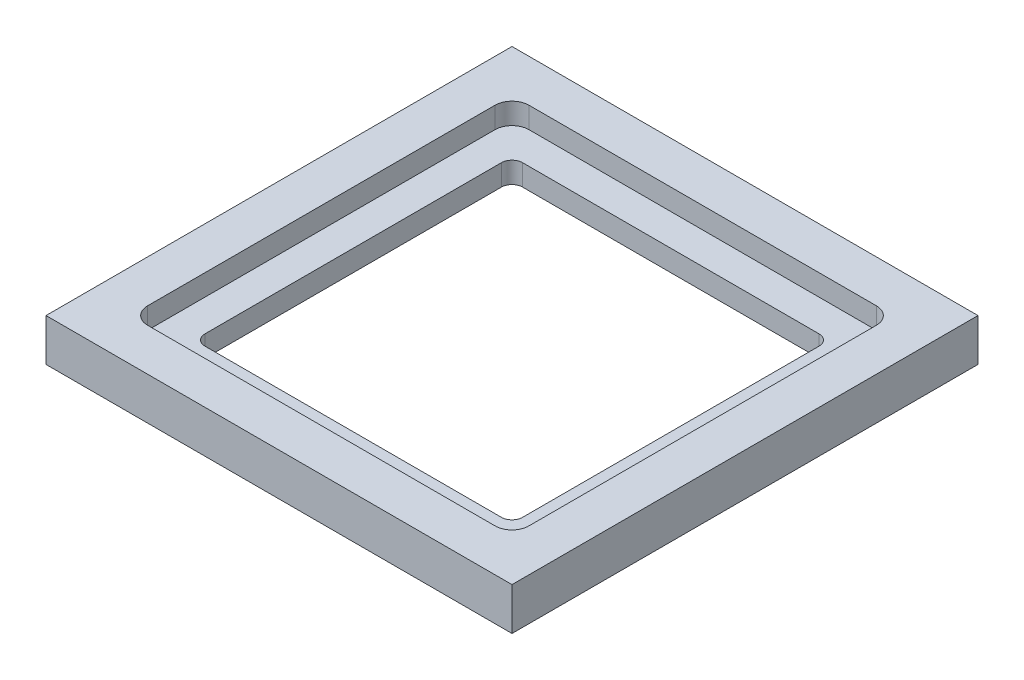
ISO-10303-21;
HEADER;
FILE_DESCRIPTION(('STEP AP214'),'2;1');
FILE_NAME('part.step','',(''),(''),'','','');
FILE_SCHEMA(('AUTOMOTIVE_DESIGN { 1 0 10303 214 1 1 1 1 }'));
ENDSEC;
DATA;
#1=APPLICATION_CONTEXT('core data for automotive mechanical design processes');
#2=APPLICATION_PROTOCOL_DEFINITION('international standard','automotive_design',2000,#1);
#3=PRODUCT_CONTEXT('',#1,'mechanical');
#4=PRODUCT('Part','Part','',(#3));
#5=PRODUCT_RELATED_PRODUCT_CATEGORY('part','',(#4));
#6=PRODUCT_DEFINITION_FORMATION('','',#4);
#7=PRODUCT_DEFINITION_CONTEXT('part definition',#1,'design');
#8=PRODUCT_DEFINITION('design','',#6,#7);
#9=PRODUCT_DEFINITION_SHAPE('','',#8);
#10=(LENGTH_UNIT() NAMED_UNIT(*) SI_UNIT(.MILLI.,.METRE.));
#11=(NAMED_UNIT(*) PLANE_ANGLE_UNIT() SI_UNIT($,.RADIAN.));
#12=(NAMED_UNIT(*) SI_UNIT($,.STERADIAN.) SOLID_ANGLE_UNIT());
#13=UNCERTAINTY_MEASURE_WITH_UNIT(LENGTH_MEASURE(1.E-05),#10,'distance_accuracy_value','');
#14=(GEOMETRIC_REPRESENTATION_CONTEXT(3) GLOBAL_UNCERTAINTY_ASSIGNED_CONTEXT((#13)) GLOBAL_UNIT_ASSIGNED_CONTEXT((#10,
#11,#12)) REPRESENTATION_CONTEXT('',''));
#15=CARTESIAN_POINT('',(0.,0.,0.));
#16=DIRECTION('',(0.,0.,1.));
#17=DIRECTION('',(1.,0.,0.));
#18=AXIS2_PLACEMENT_3D('',#15,#16,#17);
#19=CARTESIAN_POINT('',(0.,2.,22.));
#20=DIRECTION('',(0.,0.,-1.));
#21=DIRECTION('',(-1.,0.,0.));
#22=AXIS2_PLACEMENT_3D('',#19,#20,#21);
#23=PLANE('',#22);
#24=DIRECTION('',(0.,-1.,0.));
#25=VECTOR('',#24,1.);
#26=CARTESIAN_POINT('',(-22.,2.,22.));
#27=LINE('',#26,#25);
#28=CARTESIAN_POINT('',(-22.,2.,22.));
#29=VERTEX_POINT('',#28);
#30=CARTESIAN_POINT('',(-22.,-2.,22.));
#31=VERTEX_POINT('',#30);
#32=EDGE_CURVE('E194',#29,#31,#27,.T.);
#33=ORIENTED_EDGE('',*,*,#32,.T.);
#34=DIRECTION('',(-1.,0.,0.));
#35=VECTOR('',#34,1.);
#36=CARTESIAN_POINT('',(-22.,-2.,22.));
#37=LINE('',#36,#35);
#38=CARTESIAN_POINT('',(22.,-2.,22.));
#39=VERTEX_POINT('',#38);
#40=EDGE_CURVE('E193',#39,#31,#37,.T.);
#41=ORIENTED_EDGE('',*,*,#40,.F.);
#42=DIRECTION('',(0.,-1.,0.));
#43=VECTOR('',#42,1.);
#44=CARTESIAN_POINT('',(22.,2.,22.));
#45=LINE('',#44,#43);
#46=CARTESIAN_POINT('',(22.,2.,22.));
#47=VERTEX_POINT('',#46);
#48=EDGE_CURVE('E179',#47,#39,#45,.T.);
#49=ORIENTED_EDGE('',*,*,#48,.F.);
#50=DIRECTION('',(1.,0.,0.));
#51=VECTOR('',#50,1.);
#52=CARTESIAN_POINT('',(0.,2.,22.));
#53=LINE('',#52,#51);
#54=EDGE_CURVE('E228',#29,#47,#53,.T.);
#55=ORIENTED_EDGE('',*,*,#54,.F.);
#56=EDGE_LOOP('',(#33,#41,#49,#55));
#57=FACE_BOUND('',#56,.T.);
#58=ADVANCED_FACE('F41',(#57),#23,.F.);
#59=CARTESIAN_POINT('',(22.,2.,0.));
#60=DIRECTION('',(-1.,0.,0.));
#61=DIRECTION('',(0.,0.,1.));
#62=AXIS2_PLACEMENT_3D('',#59,#60,#61);
#63=PLANE('',#62);
#64=ORIENTED_EDGE('',*,*,#48,.T.);
#65=DIRECTION('',(0.,0.,1.));
#66=VECTOR('',#65,1.);
#67=CARTESIAN_POINT('',(22.,-2.,-22.));
#68=LINE('',#67,#66);
#69=CARTESIAN_POINT('',(22.,-2.,-22.));
#70=VERTEX_POINT('',#69);
#71=EDGE_CURVE('E184',#70,#39,#68,.T.);
#72=ORIENTED_EDGE('',*,*,#71,.F.);
#73=DIRECTION('',(0.,-1.,0.));
#74=VECTOR('',#73,1.);
#75=CARTESIAN_POINT('',(22.,2.,-22.));
#76=LINE('',#75,#74);
#77=CARTESIAN_POINT('',(22.,2.,-22.));
#78=VERTEX_POINT('',#77);
#79=EDGE_CURVE('E190',#78,#70,#76,.T.);
#80=ORIENTED_EDGE('',*,*,#79,.F.);
#81=DIRECTION('',(0.,0.,-1.));
#82=VECTOR('',#81,1.);
#83=CARTESIAN_POINT('',(22.,2.,0.));
#84=LINE('',#83,#82);
#85=EDGE_CURVE('E185',#47,#78,#84,.T.);
#86=ORIENTED_EDGE('',*,*,#85,.F.);
#87=EDGE_LOOP('',(#64,#72,#80,#86));
#88=FACE_BOUND('',#87,.T.);
#89=ADVANCED_FACE('F181',(#88),#63,.F.);
#90=CARTESIAN_POINT('',(0.,2.,-22.));
#91=DIRECTION('',(0.,0.,-1.));
#92=DIRECTION('',(-1.,0.,0.));
#93=AXIS2_PLACEMENT_3D('',#90,#91,#92);
#94=PLANE('',#93);
#95=ORIENTED_EDGE('',*,*,#79,.T.);
#96=DIRECTION('',(1.,0.,0.));
#97=VECTOR('',#96,1.);
#98=CARTESIAN_POINT('',(-22.,-2.,-22.));
#99=LINE('',#98,#97);
#100=CARTESIAN_POINT('',(-22.,-2.,-22.));
#101=VERTEX_POINT('',#100);
#102=EDGE_CURVE('E203',#101,#70,#99,.T.);
#103=ORIENTED_EDGE('',*,*,#102,.F.);
#104=DIRECTION('',(0.,-1.,0.));
#105=VECTOR('',#104,1.);
#106=CARTESIAN_POINT('',(-22.,2.,-22.));
#107=LINE('',#106,#105);
#108=CARTESIAN_POINT('',(-22.,2.,-22.));
#109=VERTEX_POINT('',#108);
#110=EDGE_CURVE('E246',#109,#101,#107,.T.);
#111=ORIENTED_EDGE('',*,*,#110,.F.);
#112=DIRECTION('',(1.,0.,0.));
#113=VECTOR('',#112,1.);
#114=CARTESIAN_POINT('',(0.,2.,-22.));
#115=LINE('',#114,#113);
#116=EDGE_CURVE('E231',#109,#78,#115,.T.);
#117=ORIENTED_EDGE('',*,*,#116,.T.);
#118=EDGE_LOOP('',(#95,#103,#111,#117));
#119=FACE_BOUND('',#118,.T.);
#120=ADVANCED_FACE('F377',(#119),#94,.T.);
#121=CARTESIAN_POINT('',(18.,2.,0.));
#122=DIRECTION('',(-1.,0.,0.));
#123=DIRECTION('',(0.,0.,1.));
#124=AXIS2_PLACEMENT_3D('',#121,#122,#123);
#125=PLANE('',#124);
#126=DIRECTION('',(0.,0.,-1.));
#127=VECTOR('',#126,1.);
#128=CARTESIAN_POINT('',(18.,0.,0.));
#129=LINE('',#128,#127);
#130=CARTESIAN_POINT('',(18.,0.,16.4));
#131=VERTEX_POINT('',#130);
#132=CARTESIAN_POINT('',(18.,0.,-16.4));
#133=VERTEX_POINT('',#132);
#134=EDGE_CURVE('E214',#131,#133,#129,.T.);
#135=ORIENTED_EDGE('',*,*,#134,.F.);
#136=DIRECTION('',(0.,-1.,0.));
#137=VECTOR('',#136,1.);
#138=CARTESIAN_POINT('',(18.,2.,16.4));
#139=LINE('',#138,#137);
#140=CARTESIAN_POINT('',(18.,2.,16.4));
#141=VERTEX_POINT('',#140);
#142=EDGE_CURVE('E261',#131,#141,#139,.F.);
#143=ORIENTED_EDGE('',*,*,#142,.T.);
#144=DIRECTION('',(0.,0.,-1.));
#145=VECTOR('',#144,1.);
#146=CARTESIAN_POINT('',(18.,2.,0.));
#147=LINE('',#146,#145);
#148=CARTESIAN_POINT('',(18.,2.,-16.4));
#149=VERTEX_POINT('',#148);
#150=EDGE_CURVE('E215',#141,#149,#147,.T.);
#151=ORIENTED_EDGE('',*,*,#150,.T.);
#152=DIRECTION('',(0.,-1.,0.));
#153=VECTOR('',#152,1.);
#154=CARTESIAN_POINT('',(18.,2.,-16.4));
#155=LINE('',#154,#153);
#156=EDGE_CURVE('E258',#149,#133,#155,.T.);
#157=ORIENTED_EDGE('',*,*,#156,.T.);
#158=EDGE_LOOP('',(#135,#143,#151,#157));
#159=FACE_BOUND('',#158,.T.);
#160=ADVANCED_FACE('F393',(#159),#125,.T.);
#161=CARTESIAN_POINT('',(0.,2.,18.));
#162=DIRECTION('',(0.,0.,-1.));
#163=DIRECTION('',(-1.,0.,0.));
#164=AXIS2_PLACEMENT_3D('',#161,#162,#163);
#165=PLANE('',#164);
#166=DIRECTION('',(1.,0.,0.));
#167=VECTOR('',#166,1.);
#168=CARTESIAN_POINT('',(0.,0.,18.));
#169=LINE('',#168,#167);
#170=CARTESIAN_POINT('',(-16.4,0.,18.));
#171=VERTEX_POINT('',#170);
#172=CARTESIAN_POINT('',(16.4,0.,18.));
#173=VERTEX_POINT('',#172);
#174=EDGE_CURVE('E239',#171,#173,#169,.T.);
#175=ORIENTED_EDGE('',*,*,#174,.F.);
#176=DIRECTION('',(0.,-1.,0.));
#177=VECTOR('',#176,1.);
#178=CARTESIAN_POINT('',(-16.4,2.,18.));
#179=LINE('',#178,#177);
#180=CARTESIAN_POINT('',(-16.4,2.,18.));
#181=VERTEX_POINT('',#180);
#182=EDGE_CURVE('E256',#171,#181,#179,.F.);
#183=ORIENTED_EDGE('',*,*,#182,.T.);
#184=DIRECTION('',(1.,0.,0.));
#185=VECTOR('',#184,1.);
#186=CARTESIAN_POINT('',(0.,2.,18.));
#187=LINE('',#186,#185);
#188=CARTESIAN_POINT('',(16.4,2.,18.));
#189=VERTEX_POINT('',#188);
#190=EDGE_CURVE('E218',#181,#189,#187,.T.);
#191=ORIENTED_EDGE('',*,*,#190,.T.);
#192=DIRECTION('',(0.,-1.,0.));
#193=VECTOR('',#192,1.);
#194=CARTESIAN_POINT('',(16.4,0.,18.));
#195=LINE('',#194,#193);
#196=EDGE_CURVE('E253',#189,#173,#195,.T.);
#197=ORIENTED_EDGE('',*,*,#196,.T.);
#198=EDGE_LOOP('',(#175,#183,#191,#197));
#199=FACE_BOUND('',#198,.T.);
#200=ADVANCED_FACE('F389',(#199),#165,.T.);
#201=CARTESIAN_POINT('',(-18.,2.,0.));
#202=DIRECTION('',(-1.,0.,0.));
#203=DIRECTION('',(0.,0.,1.));
#204=AXIS2_PLACEMENT_3D('',#201,#202,#203);
#205=PLANE('',#204);
#206=DIRECTION('',(0.,0.,-1.));
#207=VECTOR('',#206,1.);
#208=CARTESIAN_POINT('',(-18.,2.,0.));
#209=LINE('',#208,#207);
#210=CARTESIAN_POINT('',(-18.,2.,16.4));
#211=VERTEX_POINT('',#210);
#212=CARTESIAN_POINT('',(-18.,2.,-16.4));
#213=VERTEX_POINT('',#212);
#214=EDGE_CURVE('E222',#211,#213,#209,.T.);
#215=ORIENTED_EDGE('',*,*,#214,.F.);
#216=DIRECTION('',(0.,-1.,0.));
#217=VECTOR('',#216,1.);
#218=CARTESIAN_POINT('',(-18.,2.,16.4));
#219=LINE('',#218,#217);
#220=CARTESIAN_POINT('',(-18.,0.,16.4));
#221=VERTEX_POINT('',#220);
#222=EDGE_CURVE('E250',#211,#221,#219,.T.);
#223=ORIENTED_EDGE('',*,*,#222,.T.);
#224=DIRECTION('',(0.,0.,-1.));
#225=VECTOR('',#224,1.);
#226=CARTESIAN_POINT('',(-18.,0.,0.));
#227=LINE('',#226,#225);
#228=CARTESIAN_POINT('',(-18.,0.,-16.4));
#229=VERTEX_POINT('',#228);
#230=EDGE_CURVE('E242',#221,#229,#227,.T.);
#231=ORIENTED_EDGE('',*,*,#230,.T.);
#232=DIRECTION('',(0.,-1.,0.));
#233=VECTOR('',#232,1.);
#234=CARTESIAN_POINT('',(-18.,2.,-16.4));
#235=LINE('',#234,#233);
#236=EDGE_CURVE('E189',#229,#213,#235,.F.);
#237=ORIENTED_EDGE('',*,*,#236,.T.);
#238=EDGE_LOOP('',(#215,#223,#231,#237));
#239=FACE_BOUND('',#238,.T.);
#240=ADVANCED_FACE('F385',(#239),#205,.F.);
#241=CARTESIAN_POINT('',(0.,2.,-18.));
#242=DIRECTION('',(0.,0.,-1.));
#243=DIRECTION('',(-1.,0.,0.));
#244=AXIS2_PLACEMENT_3D('',#241,#242,#243);
#245=PLANE('',#244);
#246=DIRECTION('',(1.,0.,0.));
#247=VECTOR('',#246,1.);
#248=CARTESIAN_POINT('',(0.,0.,-18.));
#249=LINE('',#248,#247);
#250=CARTESIAN_POINT('',(-16.4,0.,-18.));
#251=VERTEX_POINT('',#250);
#252=CARTESIAN_POINT('',(16.4,0.,-18.));
#253=VERTEX_POINT('',#252);
#254=EDGE_CURVE('E219',#251,#253,#249,.T.);
#255=ORIENTED_EDGE('',*,*,#254,.T.);
#256=DIRECTION('',(0.,-1.,0.));
#257=VECTOR('',#256,1.);
#258=CARTESIAN_POINT('',(16.4,2.,-18.));
#259=LINE('',#258,#257);
#260=CARTESIAN_POINT('',(16.4,2.,-18.));
#261=VERTEX_POINT('',#260);
#262=EDGE_CURVE('E266',#253,#261,#259,.F.);
#263=ORIENTED_EDGE('',*,*,#262,.T.);
#264=DIRECTION('',(1.,0.,0.));
#265=VECTOR('',#264,1.);
#266=CARTESIAN_POINT('',(0.,2.,-18.));
#267=LINE('',#266,#265);
#268=CARTESIAN_POINT('',(-16.4,2.,-18.));
#269=VERTEX_POINT('',#268);
#270=EDGE_CURVE('E225',#269,#261,#267,.T.);
#271=ORIENTED_EDGE('',*,*,#270,.F.);
#272=DIRECTION('',(0.,-1.,0.));
#273=VECTOR('',#272,1.);
#274=CARTESIAN_POINT('',(-16.4,0.,-18.));
#275=LINE('',#274,#273);
#276=EDGE_CURVE('E263',#269,#251,#275,.T.);
#277=ORIENTED_EDGE('',*,*,#276,.T.);
#278=EDGE_LOOP('',(#255,#263,#271,#277));
#279=FACE_BOUND('',#278,.T.);
#280=ADVANCED_FACE('F381',(#279),#245,.F.);
#281=CARTESIAN_POINT('',(-22.,2.,0.));
#282=DIRECTION('',(-1.,0.,0.));
#283=DIRECTION('',(0.,0.,1.));
#284=AXIS2_PLACEMENT_3D('',#281,#282,#283);
#285=PLANE('',#284);
#286=ORIENTED_EDGE('',*,*,#110,.T.);
#287=DIRECTION('',(0.,0.,-1.));
#288=VECTOR('',#287,1.);
#289=CARTESIAN_POINT('',(-22.,-2.,-22.));
#290=LINE('',#289,#288);
#291=EDGE_CURVE('E198',#31,#101,#290,.T.);
#292=ORIENTED_EDGE('',*,*,#291,.F.);
#293=ORIENTED_EDGE('',*,*,#32,.F.);
#294=DIRECTION('',(0.,0.,-1.));
#295=VECTOR('',#294,1.);
#296=CARTESIAN_POINT('',(-22.,2.,0.));
#297=LINE('',#296,#295);
#298=EDGE_CURVE('E234',#29,#109,#297,.T.);
#299=ORIENTED_EDGE('',*,*,#298,.T.);
#300=EDGE_LOOP('',(#286,#292,#293,#299));
#301=FACE_BOUND('',#300,.T.);
#302=ADVANCED_FACE('F384',(#301),#285,.T.);
#303=CARTESIAN_POINT('',(0.,2.,0.));
#304=DIRECTION('',(0.,1.,0.));
#305=DIRECTION('',(0.,0.,1.));
#306=AXIS2_PLACEMENT_3D('',#303,#304,#305);
#307=PLANE('',#306);
#308=ORIENTED_EDGE('',*,*,#150,.F.);
#309=CARTESIAN_POINT('',(16.4,2.,16.4));
#310=DIRECTION('',(0.,1.,0.));
#311=DIRECTION('',(0.,0.,1.));
#312=AXIS2_PLACEMENT_3D('',#309,#310,#311);
#313=CIRCLE('',#312,1.6);
#314=EDGE_CURVE('E276',#141,#189,#313,.F.);
#315=ORIENTED_EDGE('',*,*,#314,.T.);
#316=ORIENTED_EDGE('',*,*,#190,.F.);
#317=CARTESIAN_POINT('',(-16.4,2.,16.4));
#318=DIRECTION('',(0.,1.,0.));
#319=DIRECTION('',(0.,0.,1.));
#320=AXIS2_PLACEMENT_3D('',#317,#318,#319);
#321=CIRCLE('',#320,1.6);
#322=EDGE_CURVE('E271',#181,#211,#321,.F.);
#323=ORIENTED_EDGE('',*,*,#322,.T.);
#324=ORIENTED_EDGE('',*,*,#214,.T.);
#325=CARTESIAN_POINT('',(-16.4,2.,-16.4));
#326=DIRECTION('',(0.,1.,0.));
#327=DIRECTION('',(0.,0.,1.));
#328=AXIS2_PLACEMENT_3D('',#325,#326,#327);
#329=CIRCLE('',#328,1.6);
#330=EDGE_CURVE('E286',#213,#269,#329,.F.);
#331=ORIENTED_EDGE('',*,*,#330,.T.);
#332=ORIENTED_EDGE('',*,*,#270,.T.);
#333=CARTESIAN_POINT('',(16.4,2.,-16.4));
#334=DIRECTION('',(0.,1.,0.));
#335=DIRECTION('',(0.,0.,1.));
#336=AXIS2_PLACEMENT_3D('',#333,#334,#335);
#337=CIRCLE('',#336,1.6);
#338=EDGE_CURVE('E281',#261,#149,#337,.F.);
#339=ORIENTED_EDGE('',*,*,#338,.T.);
#340=EDGE_LOOP('',(#308,#315,#316,#323,#324,#331,#332,#339));
#341=FACE_BOUND('',#340,.T.);
#342=ORIENTED_EDGE('',*,*,#54,.T.);
#343=ORIENTED_EDGE('',*,*,#85,.T.);
#344=ORIENTED_EDGE('',*,*,#116,.F.);
#345=ORIENTED_EDGE('',*,*,#298,.F.);
#346=EDGE_LOOP('',(#342,#343,#344,#345));
#347=FACE_BOUND('',#346,.T.);
#348=ADVANCED_FACE('F402',(#341,#347),#307,.T.);
#349=CARTESIAN_POINT('',(-16.4,2.,16.4));
#350=DIRECTION('',(0.,-1.,0.));
#351=DIRECTION('',(0.,0.,-1.));
#352=AXIS2_PLACEMENT_3D('',#349,#350,#351);
#353=CYLINDRICAL_SURFACE('',#352,1.6);
#354=ORIENTED_EDGE('',*,*,#322,.F.);
#355=ORIENTED_EDGE('',*,*,#182,.F.);
#356=CARTESIAN_POINT('',(-16.4,0.,16.4));
#357=DIRECTION('',(0.,1.,0.));
#358=DIRECTION('',(0.,0.,1.));
#359=AXIS2_PLACEMENT_3D('',#356,#357,#358);
#360=CIRCLE('',#359,1.6);
#361=EDGE_CURVE('E268',#221,#171,#360,.T.);
#362=ORIENTED_EDGE('',*,*,#361,.F.);
#363=ORIENTED_EDGE('',*,*,#222,.F.);
#364=EDGE_LOOP('',(#354,#355,#362,#363));
#365=FACE_BOUND('',#364,.T.);
#366=ADVANCED_FACE('F398',(#365),#353,.F.);
#367=CARTESIAN_POINT('',(16.4,2.,16.4));
#368=DIRECTION('',(0.,1.,0.));
#369=DIRECTION('',(0.,0.,1.));
#370=AXIS2_PLACEMENT_3D('',#367,#368,#369);
#371=CYLINDRICAL_SURFACE('',#370,1.6);
#372=ORIENTED_EDGE('',*,*,#314,.F.);
#373=ORIENTED_EDGE('',*,*,#142,.F.);
#374=CARTESIAN_POINT('',(16.4,0.,16.4));
#375=DIRECTION('',(0.,1.,0.));
#376=DIRECTION('',(0.,0.,1.));
#377=AXIS2_PLACEMENT_3D('',#374,#375,#376);
#378=CIRCLE('',#377,1.6);
#379=EDGE_CURVE('E273',#173,#131,#378,.T.);
#380=ORIENTED_EDGE('',*,*,#379,.F.);
#381=ORIENTED_EDGE('',*,*,#196,.F.);
#382=EDGE_LOOP('',(#372,#373,#380,#381));
#383=FACE_BOUND('',#382,.T.);
#384=ADVANCED_FACE('F401',(#383),#371,.F.);
#385=CARTESIAN_POINT('',(16.4,2.,-16.4));
#386=DIRECTION('',(0.,-1.,0.));
#387=DIRECTION('',(0.,0.,-1.));
#388=AXIS2_PLACEMENT_3D('',#385,#386,#387);
#389=CYLINDRICAL_SURFACE('',#388,1.6);
#390=ORIENTED_EDGE('',*,*,#338,.F.);
#391=ORIENTED_EDGE('',*,*,#262,.F.);
#392=CARTESIAN_POINT('',(16.4,0.,-16.4));
#393=DIRECTION('',(0.,1.,0.));
#394=DIRECTION('',(0.,0.,1.));
#395=AXIS2_PLACEMENT_3D('',#392,#393,#394);
#396=CIRCLE('',#395,1.6);
#397=EDGE_CURVE('E278',#133,#253,#396,.T.);
#398=ORIENTED_EDGE('',*,*,#397,.F.);
#399=ORIENTED_EDGE('',*,*,#156,.F.);
#400=EDGE_LOOP('',(#390,#391,#398,#399));
#401=FACE_BOUND('',#400,.T.);
#402=ADVANCED_FACE('F406',(#401),#389,.F.);
#403=CARTESIAN_POINT('',(-16.4,2.,-16.4));
#404=DIRECTION('',(0.,1.,0.));
#405=DIRECTION('',(0.,0.,1.));
#406=AXIS2_PLACEMENT_3D('',#403,#404,#405);
#407=CYLINDRICAL_SURFACE('',#406,1.6);
#408=ORIENTED_EDGE('',*,*,#330,.F.);
#409=ORIENTED_EDGE('',*,*,#236,.F.);
#410=CARTESIAN_POINT('',(-16.4,0.,-16.4));
#411=DIRECTION('',(0.,1.,0.));
#412=DIRECTION('',(0.,0.,1.));
#413=AXIS2_PLACEMENT_3D('',#410,#411,#412);
#414=CIRCLE('',#413,1.6);
#415=EDGE_CURVE('E283',#251,#229,#414,.T.);
#416=ORIENTED_EDGE('',*,*,#415,.F.);
#417=ORIENTED_EDGE('',*,*,#276,.F.);
#418=EDGE_LOOP('',(#408,#409,#416,#417));
#419=FACE_BOUND('',#418,.T.);
#420=ADVANCED_FACE('F410',(#419),#407,.F.);
#421=CARTESIAN_POINT('',(0.,0.,0.));
#422=DIRECTION('',(0.,1.,0.));
#423=DIRECTION('',(0.,0.,1.));
#424=AXIS2_PLACEMENT_3D('',#421,#422,#423);
#425=PLANE('',#424);
#426=DIRECTION('',(0.,0.,-1.));
#427=VECTOR('',#426,1.);
#428=CARTESIAN_POINT('',(-15.,0.,-15.));
#429=LINE('',#428,#427);
#430=CARTESIAN_POINT('',(-15.,0.,14.));
#431=VERTEX_POINT('',#430);
#432=CARTESIAN_POINT('',(-15.,0.,-14.));
#433=VERTEX_POINT('',#432);
#434=EDGE_CURVE('E323',#431,#433,#429,.T.);
#435=ORIENTED_EDGE('',*,*,#434,.T.);
#436=CARTESIAN_POINT('',(-14.,0.,-14.));
#437=DIRECTION('',(0.,1.,0.));
#438=DIRECTION('',(0.,0.,1.));
#439=AXIS2_PLACEMENT_3D('',#436,#437,#438);
#440=CIRCLE('',#439,1.);
#441=CARTESIAN_POINT('',(-14.,0.,-15.));
#442=VERTEX_POINT('',#441);
#443=EDGE_CURVE('E49',#433,#442,#440,.F.);
#444=ORIENTED_EDGE('',*,*,#443,.T.);
#445=DIRECTION('',(1.,0.,0.));
#446=VECTOR('',#445,1.);
#447=CARTESIAN_POINT('',(-15.,0.,-15.));
#448=LINE('',#447,#446);
#449=CARTESIAN_POINT('',(14.,0.,-15.));
#450=VERTEX_POINT('',#449);
#451=EDGE_CURVE('E209',#442,#450,#448,.T.);
#452=ORIENTED_EDGE('',*,*,#451,.T.);
#453=CARTESIAN_POINT('',(14.,0.,-14.));
#454=DIRECTION('',(0.,1.,0.));
#455=DIRECTION('',(0.,0.,1.));
#456=AXIS2_PLACEMENT_3D('',#453,#454,#455);
#457=CIRCLE('',#456,1.);
#458=CARTESIAN_POINT('',(15.,0.,-14.));
#459=VERTEX_POINT('',#458);
#460=EDGE_CURVE('E315',#450,#459,#457,.F.);
#461=ORIENTED_EDGE('',*,*,#460,.T.);
#462=DIRECTION('',(0.,0.,1.));
#463=VECTOR('',#462,1.);
#464=CARTESIAN_POINT('',(15.,0.,-15.));
#465=LINE('',#464,#463);
#466=CARTESIAN_POINT('',(15.,0.,14.));
#467=VERTEX_POINT('',#466);
#468=EDGE_CURVE('E342',#459,#467,#465,.T.);
#469=ORIENTED_EDGE('',*,*,#468,.T.);
#470=CARTESIAN_POINT('',(14.,0.,14.));
#471=DIRECTION('',(0.,1.,0.));
#472=DIRECTION('',(0.,0.,1.));
#473=AXIS2_PLACEMENT_3D('',#470,#471,#472);
#474=CIRCLE('',#473,1.);
#475=CARTESIAN_POINT('',(14.,0.,15.));
#476=VERTEX_POINT('',#475);
#477=EDGE_CURVE('E311',#467,#476,#474,.F.);
#478=ORIENTED_EDGE('',*,*,#477,.T.);
#479=DIRECTION('',(-1.,0.,0.));
#480=VECTOR('',#479,1.);
#481=CARTESIAN_POINT('',(-15.,0.,15.));
#482=LINE('',#481,#480);
#483=CARTESIAN_POINT('',(-14.,0.,15.));
#484=VERTEX_POINT('',#483);
#485=EDGE_CURVE('E345',#476,#484,#482,.T.);
#486=ORIENTED_EDGE('',*,*,#485,.T.);
#487=CARTESIAN_POINT('',(-14.,0.,14.));
#488=DIRECTION('',(0.,1.,0.));
#489=DIRECTION('',(0.,0.,1.));
#490=AXIS2_PLACEMENT_3D('',#487,#488,#489);
#491=CIRCLE('',#490,1.);
#492=EDGE_CURVE('E307',#484,#431,#491,.F.);
#493=ORIENTED_EDGE('',*,*,#492,.T.);
#494=EDGE_LOOP('',(#435,#444,#452,#461,#469,#478,#486,#493));
#495=FACE_BOUND('',#494,.T.);
#496=ORIENTED_EDGE('',*,*,#361,.T.);
#497=ORIENTED_EDGE('',*,*,#174,.T.);
#498=ORIENTED_EDGE('',*,*,#379,.T.);
#499=ORIENTED_EDGE('',*,*,#134,.T.);
#500=ORIENTED_EDGE('',*,*,#397,.T.);
#501=ORIENTED_EDGE('',*,*,#254,.F.);
#502=ORIENTED_EDGE('',*,*,#415,.T.);
#503=ORIENTED_EDGE('',*,*,#230,.F.);
#504=EDGE_LOOP('',(#496,#497,#498,#499,#500,#501,#502,#503));
#505=FACE_BOUND('',#504,.T.);
#506=ADVANCED_FACE('F320',(#495,#505),#425,.T.);
#507=CARTESIAN_POINT('',(0.,-2.,0.));
#508=DIRECTION('',(0.,1.,0.));
#509=DIRECTION('',(0.,0.,1.));
#510=AXIS2_PLACEMENT_3D('',#507,#508,#509);
#511=PLANE('',#510);
#512=ORIENTED_EDGE('',*,*,#71,.T.);
#513=ORIENTED_EDGE('',*,*,#40,.T.);
#514=ORIENTED_EDGE('',*,*,#291,.T.);
#515=ORIENTED_EDGE('',*,*,#102,.T.);
#516=EDGE_LOOP('',(#512,#513,#514,#515));
#517=FACE_BOUND('',#516,.T.);
#518=DIRECTION('',(0.,0.,1.));
#519=VECTOR('',#518,1.);
#520=CARTESIAN_POINT('',(15.,-2.,-15.));
#521=LINE('',#520,#519);
#522=CARTESIAN_POINT('',(15.,-2.,-14.));
#523=VERTEX_POINT('',#522);
#524=CARTESIAN_POINT('',(15.,-2.,14.));
#525=VERTEX_POINT('',#524);
#526=EDGE_CURVE('E328',#523,#525,#521,.T.);
#527=ORIENTED_EDGE('',*,*,#526,.F.);
#528=CARTESIAN_POINT('',(14.,-2.,-14.));
#529=DIRECTION('',(0.,1.,0.));
#530=DIRECTION('',(0.,0.,1.));
#531=AXIS2_PLACEMENT_3D('',#528,#529,#530);
#532=CIRCLE('',#531,1.);
#533=CARTESIAN_POINT('',(14.,-2.,-15.));
#534=VERTEX_POINT('',#533);
#535=EDGE_CURVE('E56',#523,#534,#532,.T.);
#536=ORIENTED_EDGE('',*,*,#535,.T.);
#537=DIRECTION('',(1.,0.,0.));
#538=VECTOR('',#537,1.);
#539=CARTESIAN_POINT('',(-15.,-2.,-15.));
#540=LINE('',#539,#538);
#541=CARTESIAN_POINT('',(-14.,-2.,-15.));
#542=VERTEX_POINT('',#541);
#543=EDGE_CURVE('E204',#542,#534,#540,.T.);
#544=ORIENTED_EDGE('',*,*,#543,.F.);
#545=CARTESIAN_POINT('',(-14.,-2.,-14.));
#546=DIRECTION('',(0.,1.,0.));
#547=DIRECTION('',(0.,0.,1.));
#548=AXIS2_PLACEMENT_3D('',#545,#546,#547);
#549=CIRCLE('',#548,1.);
#550=CARTESIAN_POINT('',(-15.,-2.,-14.));
#551=VERTEX_POINT('',#550);
#552=EDGE_CURVE('E11',#542,#551,#549,.T.);
#553=ORIENTED_EDGE('',*,*,#552,.T.);
#554=DIRECTION('',(0.,0.,-1.));
#555=VECTOR('',#554,1.);
#556=CARTESIAN_POINT('',(-15.,-2.,-15.));
#557=LINE('',#556,#555);
#558=CARTESIAN_POINT('',(-15.,-2.,14.));
#559=VERTEX_POINT('',#558);
#560=EDGE_CURVE('E206',#559,#551,#557,.T.);
#561=ORIENTED_EDGE('',*,*,#560,.F.);
#562=CARTESIAN_POINT('',(-14.,-2.,14.));
#563=DIRECTION('',(0.,1.,0.));
#564=DIRECTION('',(0.,0.,1.));
#565=AXIS2_PLACEMENT_3D('',#562,#563,#564);
#566=CIRCLE('',#565,1.);
#567=CARTESIAN_POINT('',(-14.,-2.,15.));
#568=VERTEX_POINT('',#567);
#569=EDGE_CURVE('E309',#559,#568,#566,.T.);
#570=ORIENTED_EDGE('',*,*,#569,.T.);
#571=DIRECTION('',(-1.,0.,0.));
#572=VECTOR('',#571,1.);
#573=CARTESIAN_POINT('',(-15.,-2.,15.));
#574=LINE('',#573,#572);
#575=CARTESIAN_POINT('',(14.,-2.,15.));
#576=VERTEX_POINT('',#575);
#577=EDGE_CURVE('E336',#576,#568,#574,.T.);
#578=ORIENTED_EDGE('',*,*,#577,.F.);
#579=CARTESIAN_POINT('',(14.,-2.,14.));
#580=DIRECTION('',(0.,1.,0.));
#581=DIRECTION('',(0.,0.,1.));
#582=AXIS2_PLACEMENT_3D('',#579,#580,#581);
#583=CIRCLE('',#582,1.);
#584=EDGE_CURVE('E313',#576,#525,#583,.T.);
#585=ORIENTED_EDGE('',*,*,#584,.T.);
#586=EDGE_LOOP('',(#527,#536,#544,#553,#561,#570,#578,#585));
#587=FACE_BOUND('',#586,.T.);
#588=ADVANCED_FACE('F201',(#517,#587),#511,.F.);
#589=CARTESIAN_POINT('',(15.,-2.,-15.));
#590=DIRECTION('',(-1.,0.,0.));
#591=DIRECTION('',(0.,0.,1.));
#592=AXIS2_PLACEMENT_3D('',#589,#590,#591);
#593=PLANE('',#592);
#594=ORIENTED_EDGE('',*,*,#526,.T.);
#595=DIRECTION('',(0.,1.,0.));
#596=VECTOR('',#595,1.);
#597=CARTESIAN_POINT('',(15.,0.,14.));
#598=LINE('',#597,#596);
#599=EDGE_CURVE('E300',#525,#467,#598,.T.);
#600=ORIENTED_EDGE('',*,*,#599,.T.);
#601=ORIENTED_EDGE('',*,*,#468,.F.);
#602=DIRECTION('',(0.,1.,0.));
#603=VECTOR('',#602,1.);
#604=CARTESIAN_POINT('',(15.,-2.,-14.));
#605=LINE('',#604,#603);
#606=EDGE_CURVE('E298',#459,#523,#605,.F.);
#607=ORIENTED_EDGE('',*,*,#606,.T.);
#608=EDGE_LOOP('',(#594,#600,#601,#607));
#609=FACE_BOUND('',#608,.T.);
#610=ADVANCED_FACE('F359',(#609),#593,.T.);
#611=CARTESIAN_POINT('',(-15.,-2.,15.));
#612=DIRECTION('',(0.,0.,-1.));
#613=DIRECTION('',(-1.,0.,0.));
#614=AXIS2_PLACEMENT_3D('',#611,#612,#613);
#615=PLANE('',#614);
#616=ORIENTED_EDGE('',*,*,#577,.T.);
#617=DIRECTION('',(0.,1.,0.));
#618=VECTOR('',#617,1.);
#619=CARTESIAN_POINT('',(-14.,0.,15.));
#620=LINE('',#619,#618);
#621=EDGE_CURVE('E290',#568,#484,#620,.T.);
#622=ORIENTED_EDGE('',*,*,#621,.T.);
#623=ORIENTED_EDGE('',*,*,#485,.F.);
#624=DIRECTION('',(0.,1.,0.));
#625=VECTOR('',#624,1.);
#626=CARTESIAN_POINT('',(14.,-2.,15.));
#627=LINE('',#626,#625);
#628=EDGE_CURVE('E288',#476,#576,#627,.F.);
#629=ORIENTED_EDGE('',*,*,#628,.T.);
#630=EDGE_LOOP('',(#616,#622,#623,#629));
#631=FACE_BOUND('',#630,.T.);
#632=ADVANCED_FACE('F350',(#631),#615,.T.);
#633=CARTESIAN_POINT('',(-15.,-2.,-15.));
#634=DIRECTION('',(1.,0.,0.));
#635=DIRECTION('',(0.,0.,-1.));
#636=AXIS2_PLACEMENT_3D('',#633,#634,#635);
#637=PLANE('',#636);
#638=ORIENTED_EDGE('',*,*,#434,.F.);
#639=DIRECTION('',(0.,1.,0.));
#640=VECTOR('',#639,1.);
#641=CARTESIAN_POINT('',(-15.,-2.,14.));
#642=LINE('',#641,#640);
#643=EDGE_CURVE('E296',#431,#559,#642,.F.);
#644=ORIENTED_EDGE('',*,*,#643,.T.);
#645=ORIENTED_EDGE('',*,*,#560,.T.);
#646=DIRECTION('',(0.,1.,0.));
#647=VECTOR('',#646,1.);
#648=CARTESIAN_POINT('',(-15.,0.,-14.));
#649=LINE('',#648,#647);
#650=EDGE_CURVE('E293',#551,#433,#649,.T.);
#651=ORIENTED_EDGE('',*,*,#650,.T.);
#652=EDGE_LOOP('',(#638,#644,#645,#651));
#653=FACE_BOUND('',#652,.T.);
#654=ADVANCED_FACE('F334',(#653),#637,.T.);
#655=CARTESIAN_POINT('',(-15.,-2.,-15.));
#656=DIRECTION('',(0.,0.,1.));
#657=DIRECTION('',(1.,0.,0.));
#658=AXIS2_PLACEMENT_3D('',#655,#656,#657);
#659=PLANE('',#658);
#660=ORIENTED_EDGE('',*,*,#543,.T.);
#661=DIRECTION('',(0.,1.,0.));
#662=VECTOR('',#661,1.);
#663=CARTESIAN_POINT('',(14.,0.,-15.));
#664=LINE('',#663,#662);
#665=EDGE_CURVE('E304',#534,#450,#664,.T.);
#666=ORIENTED_EDGE('',*,*,#665,.T.);
#667=ORIENTED_EDGE('',*,*,#451,.F.);
#668=DIRECTION('',(0.,1.,0.));
#669=VECTOR('',#668,1.);
#670=CARTESIAN_POINT('',(-14.,-2.,-15.));
#671=LINE('',#670,#669);
#672=EDGE_CURVE('E63',#442,#542,#671,.F.);
#673=ORIENTED_EDGE('',*,*,#672,.T.);
#674=EDGE_LOOP('',(#660,#666,#667,#673));
#675=FACE_BOUND('',#674,.T.);
#676=ADVANCED_FACE('F326',(#675),#659,.T.);
#677=CARTESIAN_POINT('',(-14.,-2.,14.));
#678=DIRECTION('',(0.,-1.,0.));
#679=DIRECTION('',(0.,0.,-1.));
#680=AXIS2_PLACEMENT_3D('',#677,#678,#679);
#681=CYLINDRICAL_SURFACE('',#680,1.);
#682=ORIENTED_EDGE('',*,*,#569,.F.);
#683=ORIENTED_EDGE('',*,*,#643,.F.);
#684=ORIENTED_EDGE('',*,*,#492,.F.);
#685=ORIENTED_EDGE('',*,*,#621,.F.);
#686=EDGE_LOOP('',(#682,#683,#684,#685));
#687=FACE_BOUND('',#686,.T.);
#688=ADVANCED_FACE('F369',(#687),#681,.F.);
#689=CARTESIAN_POINT('',(14.,-2.,14.));
#690=DIRECTION('',(0.,-1.,0.));
#691=DIRECTION('',(0.,0.,-1.));
#692=AXIS2_PLACEMENT_3D('',#689,#690,#691);
#693=CYLINDRICAL_SURFACE('',#692,1.);
#694=ORIENTED_EDGE('',*,*,#584,.F.);
#695=ORIENTED_EDGE('',*,*,#628,.F.);
#696=ORIENTED_EDGE('',*,*,#477,.F.);
#697=ORIENTED_EDGE('',*,*,#599,.F.);
#698=EDGE_LOOP('',(#694,#695,#696,#697));
#699=FACE_BOUND('',#698,.T.);
#700=ADVANCED_FACE('F355',(#699),#693,.F.);
#701=CARTESIAN_POINT('',(14.,-2.,-14.));
#702=DIRECTION('',(0.,-1.,0.));
#703=DIRECTION('',(0.,0.,-1.));
#704=AXIS2_PLACEMENT_3D('',#701,#702,#703);
#705=CYLINDRICAL_SURFACE('',#704,1.);
#706=ORIENTED_EDGE('',*,*,#535,.F.);
#707=ORIENTED_EDGE('',*,*,#606,.F.);
#708=ORIENTED_EDGE('',*,*,#460,.F.);
#709=ORIENTED_EDGE('',*,*,#665,.F.);
#710=EDGE_LOOP('',(#706,#707,#708,#709));
#711=FACE_BOUND('',#710,.T.);
#712=ADVANCED_FACE('F363',(#711),#705,.F.);
#713=CARTESIAN_POINT('',(-14.,-2.,-14.));
#714=DIRECTION('',(0.,-1.,0.));
#715=DIRECTION('',(0.,0.,-1.));
#716=AXIS2_PLACEMENT_3D('',#713,#714,#715);
#717=CYLINDRICAL_SURFACE('',#716,1.);
#718=ORIENTED_EDGE('',*,*,#552,.F.);
#719=ORIENTED_EDGE('',*,*,#672,.F.);
#720=ORIENTED_EDGE('',*,*,#443,.F.);
#721=ORIENTED_EDGE('',*,*,#650,.F.);
#722=EDGE_LOOP('',(#718,#719,#720,#721));
#723=FACE_BOUND('',#722,.T.);
#724=ADVANCED_FACE('F43',(#723),#717,.F.);
#725=CLOSED_SHELL('',(#58,#89,#120,#160,#200,#240,#280,#302,#348,#366,#384,#402,#420,#506,#588,
#610,#632,#654,#676,#688,#700,#712,#724));
#726=MANIFOLD_SOLID_BREP('B2',#725);
#727=ADVANCED_BREP_SHAPE_REPRESENTATION('',(#18,#726),#14);
#728=SHAPE_DEFINITION_REPRESENTATION(#9,#727);
ENDSEC;
END-ISO-10303-21;
